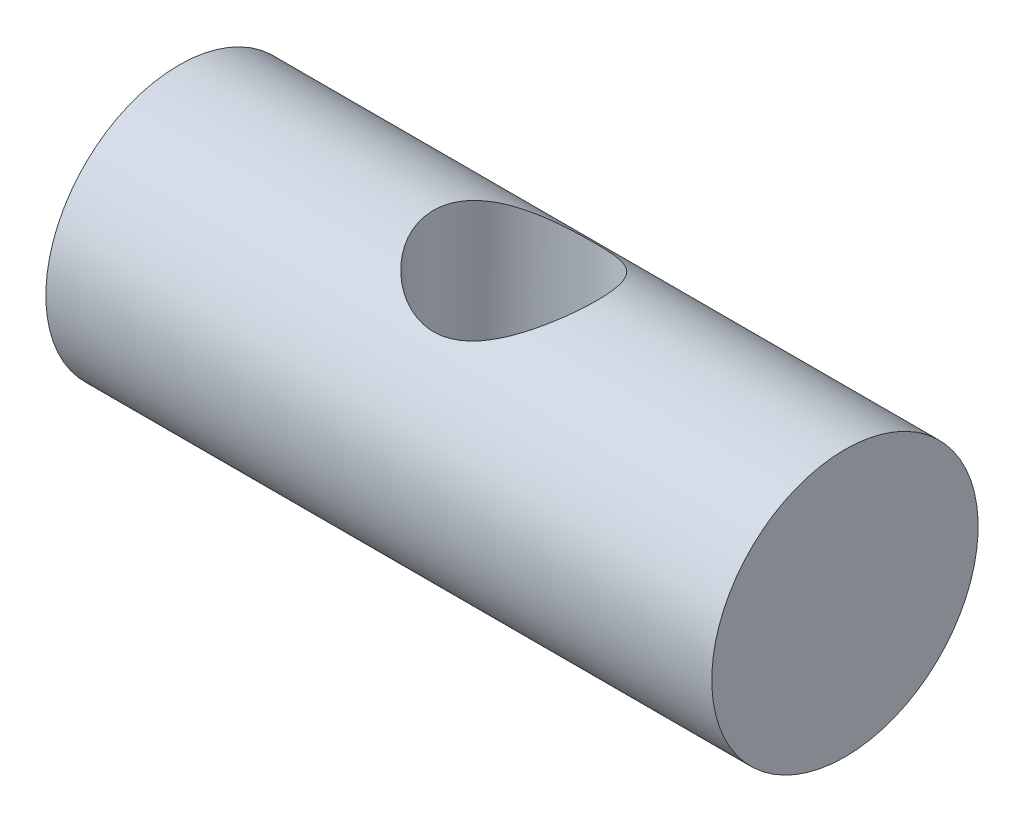
ISO-10303-21;
HEADER;
FILE_DESCRIPTION(('STEP AP214'),'2;1');
FILE_NAME('part.step','',(''),(''),'','','');
FILE_SCHEMA(('AUTOMOTIVE_DESIGN { 1 0 10303 214 1 1 1 1 }'));
ENDSEC;
DATA;
#1=APPLICATION_CONTEXT('core data for automotive mechanical design processes');
#2=APPLICATION_PROTOCOL_DEFINITION('international standard','automotive_design',2000,#1);
#3=PRODUCT_CONTEXT('',#1,'mechanical');
#4=PRODUCT('Part','Part','',(#3));
#5=PRODUCT_RELATED_PRODUCT_CATEGORY('part','',(#4));
#6=PRODUCT_DEFINITION_FORMATION('','',#4);
#7=PRODUCT_DEFINITION_CONTEXT('part definition',#1,'design');
#8=PRODUCT_DEFINITION('design','',#6,#7);
#9=PRODUCT_DEFINITION_SHAPE('','',#8);
#10=(LENGTH_UNIT() NAMED_UNIT(*) SI_UNIT(.MILLI.,.METRE.));
#11=(NAMED_UNIT(*) PLANE_ANGLE_UNIT() SI_UNIT($,.RADIAN.));
#12=(NAMED_UNIT(*) SI_UNIT($,.STERADIAN.) SOLID_ANGLE_UNIT());
#13=UNCERTAINTY_MEASURE_WITH_UNIT(LENGTH_MEASURE(1.E-05),#10,'distance_accuracy_value','');
#14=(GEOMETRIC_REPRESENTATION_CONTEXT(3) GLOBAL_UNCERTAINTY_ASSIGNED_CONTEXT((#13)) GLOBAL_UNIT_ASSIGNED_CONTEXT((#10,
#11,#12)) REPRESENTATION_CONTEXT('',''));
#15=CARTESIAN_POINT('',(0.,0.,0.));
#16=DIRECTION('',(0.,0.,1.));
#17=DIRECTION('',(1.,0.,0.));
#18=AXIS2_PLACEMENT_3D('',#15,#16,#17);
#19=CARTESIAN_POINT('',(0.,-18.7521667780927,11.6949636286788));
#20=DIRECTION('',(1.,0.,0.));
#21=DIRECTION('',(0.,0.,-1.));
#22=AXIS2_PLACEMENT_3D('',#19,#20,#21);
#23=CYLINDRICAL_SURFACE('',#22,5.);
#24=CARTESIAN_POINT('',(0.,-22.7079728146669,14.7530019870064));
#25=CARTESIAN_POINT('',(-0.0754616103656692,-22.7079727869881,14.7530018925849));
#26=CARTESIAN_POINT('',(-0.150919951825714,-22.7101598235113,14.7501801945999));
#27=CARTESIAN_POINT('',(-0.301183579155884,-22.7187979706071,14.7389544448188));
#28=CARTESIAN_POINT('',(-0.375988603680727,-22.7252507149352,14.7305482541699));
#29=CARTESIAN_POINT('',(-0.598542400800131,-22.7506525182684,14.6971206700838));
#30=CARTESIAN_POINT('',(-0.744466163038655,-22.7756453398218,14.6638901730738));
#31=CARTESIAN_POINT('',(-1.02619529387303,-22.8377881740495,14.5777461448535));
#32=CARTESIAN_POINT('',(-1.16206540972156,-22.8748502020465,14.5249746967277));
#33=CARTESIAN_POINT('',(-1.42286717142597,-22.9568438354341,14.4016544141652));
#34=CARTESIAN_POINT('',(-1.54779553947816,-23.0017777869929,14.3311002769724));
#35=CARTESIAN_POINT('',(-1.79990131024536,-23.1011785218747,14.164099369169));
#36=CARTESIAN_POINT('',(-1.92548608074575,-23.1561391267282,14.0655415030308));
#37=CARTESIAN_POINT('',(-2.15952535636892,-23.2657354853162,13.8495886872096));
#38=CARTESIAN_POINT('',(-2.26796690142325,-23.3203709635155,13.7321796201239));
#39=CARTESIAN_POINT('',(-2.47628246871425,-23.430340638655,13.4662497393904));
#40=CARTESIAN_POINT('',(-2.57396641364106,-23.4851130558413,13.3157383303768));
#41=CARTESIAN_POINT('',(-2.69974650858798,-23.558227357613,13.0765525795957));
#42=CARTESIAN_POINT('',(-2.73822411545812,-23.581096983841,12.9945605709474));
#43=CARTESIAN_POINT('',(-2.80779096487915,-23.6231850085312,12.8266215817503));
#44=CARTESIAN_POINT('',(-2.83888509171158,-23.6424058190417,12.7406772608897));
#45=CARTESIAN_POINT('',(-2.8906274624533,-23.6749802775516,12.5738461548146));
#46=CARTESIAN_POINT('',(-2.91198727152911,-23.6887177555667,12.4932541311213));
#47=CARTESIAN_POINT('',(-2.94794996135097,-23.7123521960503,12.3300637651993));
#48=CARTESIAN_POINT('',(-2.96255660763761,-23.7222512982862,12.2474665681582));
#49=CARTESIAN_POINT('',(-2.9847846845161,-23.7379430868827,12.0809888844705));
#50=CARTESIAN_POINT('',(-2.99240984231181,-23.7437379639894,11.9971091069025));
#51=CARTESIAN_POINT('',(-3.00056663984719,-23.7510849265537,11.8288489482711));
#52=CARTESIAN_POINT('',(-3.00109900129357,-23.7526374436676,11.744468619014));
#53=CARTESIAN_POINT('',(-2.99275721772027,-23.7510105836798,11.51270324337));
#54=CARTESIAN_POINT('',(-2.97652885035086,-23.7434090717095,11.3655279041117));
#55=CARTESIAN_POINT('',(-2.92304450631759,-23.7158840522797,11.0763592621349));
#56=CARTESIAN_POINT('',(-2.88578697338951,-23.6959596328524,10.9343663437699));
#57=CARTESIAN_POINT('',(-2.79166776699806,-23.6455113313597,10.6581382318312));
#58=CARTESIAN_POINT('',(-2.73469357980009,-23.6149266085636,10.5239528406406));
#59=CARTESIAN_POINT('',(-2.60323106554831,-23.5457065476715,10.2667672196502));
#60=CARTESIAN_POINT('',(-2.52873818986415,-23.5070691190319,10.1437699062945));
#61=CARTESIAN_POINT('',(-2.35432172038149,-23.419657287531,9.89672028803383));
#62=CARTESIAN_POINT('',(-2.2524233514645,-23.3702233180452,9.77429678895081));
#63=CARTESIAN_POINT('',(-2.03119178989515,-23.2690931673724,9.54720485534209));
#64=CARTESIAN_POINT('',(-1.91183500028096,-23.2173939918253,9.44256087223243));
#65=CARTESIAN_POINT('',(-1.64269317960226,-23.1106424638974,9.24179343494802));
#66=CARTESIAN_POINT('',(-1.49098484467041,-23.0558958428153,9.148062790343));
#67=CARTESIAN_POINT('',(-1.17058753897335,-22.9571237667411,8.98807902740353));
#68=CARTESIAN_POINT('',(-1.00193056868577,-22.9130786247414,8.92177529269688));
#69=CARTESIAN_POINT('',(-0.695212735504382,-22.8522758915277,8.83292726574572));
#70=CARTESIAN_POINT('',(-0.559918734207678,-22.8314618326231,8.80361235572529));
#71=CARTESIAN_POINT('',(-0.285252780598748,-22.8031999975291,8.76413643568933));
#72=CARTESIAN_POINT('',(-0.145885763115504,-22.7957366766823,8.75395314946577));
#73=CARTESIAN_POINT('',(0.133103368961626,-22.7952919170322,8.75334175749415));
#74=CARTESIAN_POINT('',(0.272725569601709,-22.802330541752,8.76294102101923));
#75=CARTESIAN_POINT('',(0.547974672313762,-22.8298474377343,8.80134077935364));
#76=CARTESIAN_POINT('',(0.683598327819899,-22.8503363319316,8.83015645144216));
#77=CARTESIAN_POINT('',(0.947429215549469,-22.901941299012,8.90544338226318));
#78=CARTESIAN_POINT('',(1.07564548413754,-22.9330440894804,8.9518925822231));
#79=CARTESIAN_POINT('',(1.32295522030751,-23.002481214324,9.06076717792625));
#80=CARTESIAN_POINT('',(1.4420452245939,-23.0408182750867,9.12319860008104));
#81=CARTESIAN_POINT('',(1.6904810952463,-23.1286721740687,9.27520997795065));
#82=CARTESIAN_POINT('',(1.81780543232944,-23.1789585203737,9.3676551847835));
#83=CARTESIAN_POINT('',(2.05656720394541,-23.2800688266411,9.57104086893459));
#84=CARTESIAN_POINT('',(2.16798924609444,-23.3308932570144,9.68199904333049));
#85=CARTESIAN_POINT('',(2.38646399131574,-23.4350388514412,9.93658208126711));
#86=CARTESIAN_POINT('',(2.49106470576288,-23.4878253551495,10.0825785290202));
#87=CARTESIAN_POINT('',(2.62815449772339,-23.5587985520089,10.3154964334324));
#88=CARTESIAN_POINT('',(2.67056200213691,-23.5810956833224,10.3954905050181));
#89=CARTESIAN_POINT('',(2.74830388347848,-23.6223025521498,10.5596586571418));
#90=CARTESIAN_POINT('',(2.7836427131187,-23.6412144213199,10.6438300643077));
#91=CARTESIAN_POINT('',(2.84447964323442,-23.6738151854542,10.8095326534457));
#92=CARTESIAN_POINT('',(2.87050371846178,-23.687782431425,10.8908163099147));
#93=CARTESIAN_POINT('',(2.91566498160908,-23.7118447299035,11.055793770821));
#94=CARTESIAN_POINT('',(2.9348060288799,-23.7219419525641,11.1394861961254));
#95=CARTESIAN_POINT('',(2.96590030971309,-23.7379341186137,11.3085423049022));
#96=CARTESIAN_POINT('',(2.97785843736055,-23.7438319237867,11.393904809425));
#97=CARTESIAN_POINT('',(2.99440676165901,-23.7512298155536,11.5654990854394));
#98=CARTESIAN_POINT('',(2.99899791878894,-23.7527304754525,11.6517307421387));
#99=CARTESIAN_POINT('',(3.0013282897594,-23.7506843562619,11.8874289341162));
#100=CARTESIAN_POINT('',(2.99160107457409,-23.7426436972747,12.0370212978));
#101=CARTESIAN_POINT('',(2.95021794585105,-23.7136685232393,12.3317423440264));
#102=CARTESIAN_POINT('',(2.9185617880599,-23.6927338645727,12.4768709768313));
#103=CARTESIAN_POINT('',(2.83555942935371,-23.6401845511299,12.7566735548822));
#104=CARTESIAN_POINT('',(2.78453656045099,-23.6087462382718,12.8914776747676));
#105=CARTESIAN_POINT('',(2.66471905823651,-23.5375077488372,13.1504998117461));
#106=CARTESIAN_POINT('',(2.59592043965643,-23.4977056975103,13.2747154466174));
#107=CARTESIAN_POINT('',(2.43415009310424,-23.4078520497102,13.5236084965356));
#108=CARTESIAN_POINT('',(2.33936493647195,-23.3571568395582,13.6468721086891));
#109=CARTESIAN_POINT('',(2.1324915754345,-23.2528541033737,13.8766539923056));
#110=CARTESIAN_POINT('',(2.0203842023356,-23.199243394177,13.9831534458078));
#111=CARTESIAN_POINT('',(1.76543895662125,-23.0867873288138,14.1902857763759));
#112=CARTESIAN_POINT('',(1.6205069155109,-23.0281402958731,14.2884620128758));
#113=CARTESIAN_POINT('',(1.31299042740473,-22.9198062299684,14.4592073038831));
#114=CARTESIAN_POINT('',(1.15041521580196,-22.8701145451891,14.5317896718642));
#115=CARTESIAN_POINT('',(0.903377447312357,-22.8100237606539,14.616411162026));
#116=CARTESIAN_POINT('',(0.824341408702766,-22.7929264257422,14.6399417433211));
#117=CARTESIAN_POINT('',(0.663869558199827,-22.7629859844,14.6805907074968));
#118=CARTESIAN_POINT('',(0.582435300012668,-22.7501401868469,14.6977131474807));
#119=CARTESIAN_POINT('',(0.417953449305935,-22.729330091554,14.7252228332853));
#120=CARTESIAN_POINT('',(0.33490863162827,-22.7213580549682,14.7356207582155));
#121=CARTESIAN_POINT('',(0.167907783336379,-22.7106797632751,14.7495099529906));
#122=CARTESIAN_POINT('',(0.0839518687375867,-22.7079728454599,14.7530020920513));
#123=CARTESIAN_POINT('',(0.,-22.7079728146669,14.7530019870064));
#124=B_SPLINE_CURVE_WITH_KNOTS('',3,(#24,#25,#26,#27,#28,#29,#30,#31,#32,#33,#34,#35,#36,#37,
#38,#39,#40,#41,#42,#43,#44,#45,#46,#47,#48,#49,#50,#51,#52,#53,#54,#55,#56,#57,#58,#59,#60,#61,
#62,#63,#64,#65,#66,#67,#68,#69,#70,#71,#72,#73,#74,#75,#76,#77,#78,#79,#80,#81,#82,#83,#84,#85,
#86,#87,#88,#89,#90,#91,#92,#93,#94,#95,#96,#97,#98,#99,#100,#101,#102,#103,#104,#105,#106,#107,
#108,#109,#110,#111,#112,#113,#114,#115,#116,#117,#118,#119,#120,#121,#122,#123),.UNSPECIFIED.,
.T.,.F.,(4,2,2,2,2,2,2,2,2,2,2,2,2,2,2,2,2,2,2,2,2,2,2,2,2,2,2,2,2,2,2,2,2,2,2,2,2,2,2,2,2,2,2,
2,2,2,2,2,2,4),(0.,0.226288173517878,0.452663065091106,0.905305714765855,1.35471981612576,
1.804268090599,2.30878181396805,2.81367513819685,3.37309572088443,3.65297634398311,
3.93267130287329,4.18580566749444,4.43879871451846,4.6916566173785,4.94448879122709,
5.38694235003539,5.82942865693065,6.27448283989929,6.71965270654932,7.21799594026829,
7.71701907227943,8.27387316194678,8.82969494223662,9.24786570023494,9.66554925202079,
10.0838110593649,10.5024036052238,10.9204742264512,11.3387027222345,11.8323285087813,
12.3264288987104,12.884776299373,13.1641700331408,13.4433872125907,13.7024631857776,
13.9613936663243,14.2201475237758,14.4788676430947,14.9267946196281,15.3747265854331,
15.8154875864153,16.2563474905318,16.7450674536299,17.2343321574792,17.7856420979722,
18.3366648323363,18.5890061072372,18.8411873492279,19.0929671157917,19.3447151893882),.UNSPECIFIED.);
#125=CARTESIAN_POINT('',(0.,-22.7079728146669,14.7530019870064));
#126=VERTEX_POINT('',#125);
#127=EDGE_CURVE('E51',#126,#126,#124,.T.);
#128=ORIENTED_EDGE('',*,*,#127,.F.);
#129=EDGE_LOOP('',(#128));
#130=FACE_BOUND('',#129,.T.);
#131=CARTESIAN_POINT('',(0.,-14.7088242638575,14.6362866834584));
#132=CARTESIAN_POINT('',(0.0754616103656553,-14.7088242942793,14.6362865898846));
#133=CARTESIAN_POINT('',(0.1509199518257,-14.7067205138531,14.6334022847359));
#134=CARTESIAN_POINT('',(0.30118357915587,-14.6984135633696,14.6219292896143));
#135=CARTESIAN_POINT('',(0.375988603680713,-14.692208822655,14.613338414033));
#136=CARTESIAN_POINT('',(0.598542400800118,-14.667793106764,14.5791839442238));
#137=CARTESIAN_POINT('',(0.744466163038641,-14.6437804483911,14.5452384099285));
#138=CARTESIAN_POINT('',(1.02619529387302,-14.5841773825658,14.4573179914349));
#139=CARTESIAN_POINT('',(1.16206540972155,-14.548670776959,14.4034876968525));
#140=CARTESIAN_POINT('',(1.42286717142596,-14.4703100064979,14.2778276886552));
#141=CARTESIAN_POINT('',(1.54779553947815,-14.4274536511858,14.2059926060906));
#142=CARTESIAN_POINT('',(1.79990131024535,-14.3329676031741,14.036162702854));
#143=CARTESIAN_POINT('',(1.92548608074573,-14.2809058918976,13.9360432777531));
#144=CARTESIAN_POINT('',(2.1595253563689,-14.1776567676555,13.7169848407549));
#145=CARTESIAN_POINT('',(2.26796690142324,-14.1264700419933,13.5980317255036));
#146=CARTESIAN_POINT('',(2.47628246871423,-14.024305876991,13.3290066071473));
#147=CARTESIAN_POINT('',(2.57396641364105,-13.973948055308,13.1769612464058));
#148=CARTESIAN_POINT('',(2.69974650858797,-13.9078432950131,12.9357441550407));
#149=CARTESIAN_POINT('',(2.73822411545811,-13.8873755803447,12.8531198127302));
#150=CARTESIAN_POINT('',(2.80779096487914,-13.8502052135932,12.6840243670481));
#151=CARTESIAN_POINT('',(2.83888509171156,-13.8335000728902,12.5975558518592));
#152=CARTESIAN_POINT('',(2.89062746245329,-13.8058068990872,12.4298453828176));
#153=CARTESIAN_POINT('',(2.91198727152909,-13.794426599489,12.3488868664882));
#154=CARTESIAN_POINT('',(2.94794996135095,-13.7755634167126,12.1850764191954));
#155=CARTESIAN_POINT('',(2.96255660763759,-13.7680783612664,12.1022255705027));
#156=CARTESIAN_POINT('',(2.98478468451609,-13.7572503590387,11.9353609374521));
#157=CARTESIAN_POINT('',(2.99240984231179,-13.7539052017559,11.8513477979542));
#158=CARTESIAN_POINT('',(3.00056663984717,-13.7514704781422,11.6829449150735));
#159=CARTESIAN_POINT('',(3.00109900129355,-13.7523804788275,11.5985552108811));
#160=CARTESIAN_POINT('',(2.99275721772025,-13.7607685680447,11.3669359630193));
#161=CARTESIAN_POINT('',(2.97652885035084,-13.7726607905773,11.2200450561759));
#162=CARTESIAN_POINT('',(2.92304450631757,-13.8086107959856,10.9318025761206));
#163=CARTESIAN_POINT('',(2.88578697338949,-13.8326694792269,10.7904514137057));
#164=CARTESIAN_POINT('',(2.79166776699804,-13.8911554589267,10.5158127581468));
#165=CARTESIAN_POINT('',(2.73469357980007,-13.9256421171956,10.3825768212568));
#166=CARTESIAN_POINT('',(2.6032310655483,-14.0023362867298,10.1275202298235));
#167=CARTESIAN_POINT('',(2.52873818986414,-14.0445458025594,10.0057025514758));
#168=CARTESIAN_POINT('',(2.35432172038148,-14.1391282732493,9.76130840586815));
#169=CARTESIAN_POINT('',(2.25242335146449,-14.192112992372,9.64037929437576));
#170=CARTESIAN_POINT('',(2.03119178989513,-14.2998256624924,9.41633457923884));
#171=CARTESIAN_POINT('',(1.91183500028094,-14.3545558931879,9.31324350396395));
#172=CARTESIAN_POINT('',(1.64269317960225,-14.467119511389,9.11567608649296));
#173=CARTESIAN_POINT('',(1.49098484467039,-14.5245774858036,9.02358261531205));
#174=CARTESIAN_POINT('',(1.17058753897333,-14.6279751559417,8.86654870424088));
#175=CARTESIAN_POINT('',(1.00193056868575,-14.6739360070609,8.80155824390853));
#176=CARTESIAN_POINT('',(0.695212735504366,-14.7373050616213,8.71452200327564));
#177=CARTESIAN_POINT('',(0.559918734207662,-14.7589655435574,8.68582683783125));
#178=CARTESIAN_POINT('',(0.285252780598731,-14.788367085937,8.64719228216835));
#179=CARTESIAN_POINT('',(0.145885763115487,-14.7961243343448,8.63723107875141));
#180=CARTESIAN_POINT('',(-0.133103368961643,-14.796586742461,8.63663292323371));
#181=CARTESIAN_POINT('',(-0.272725569601725,-14.7892710486692,8.6460227433872));
#182=CARTESIAN_POINT('',(-0.547974672313779,-14.7606455260722,8.68360332960788));
#183=CARTESIAN_POINT('',(-0.683598327819915,-14.7393246360463,8.71180895656148));
#184=CARTESIAN_POINT('',(-0.947429215549485,-14.6855450868608,8.78555822550174));
#185=CARTESIAN_POINT('',(-1.07564548413756,-14.6531003480421,8.83108020563027));
#186=CARTESIAN_POINT('',(-1.32295522030753,-14.5805162879596,8.93788257507038));
#187=CARTESIAN_POINT('',(-1.44204522459391,-14.5403740656442,8.99916890868374));
#188=CARTESIAN_POINT('',(-1.69048109524631,-14.4481225247865,9.14855237422644));
#189=CARTESIAN_POINT('',(-1.81780543232945,-14.3951604299744,9.23949108657812));
#190=CARTESIAN_POINT('',(-2.05656720394542,-14.2881592427163,9.43984022302861));
#191=CARTESIAN_POINT('',(-2.16798924609445,-14.2341191637348,9.54926832294684));
#192=CARTESIAN_POINT('',(-2.38646399131576,-14.1225902607687,9.80070446165151));
#193=CARTESIAN_POINT('',(-2.4910647057629,-14.0655666768455,9.945098674163));
#194=CARTESIAN_POINT('',(-2.6281544977234,-13.9878281457698,10.1758467308274));
#195=CARTESIAN_POINT('',(-2.67056200213692,-13.9632066217261,10.2551562139139));
#196=CARTESIAN_POINT('',(-2.7483038834785,-13.9172275706457,10.4180522392553));
#197=CARTESIAN_POINT('',(-2.78364271311871,-13.895867990858,10.5016360470837));
#198=CARTESIAN_POINT('',(-2.84447964323443,-13.8584466125301,10.6663169455303));
#199=CARTESIAN_POINT('',(-2.8705037184618,-13.8421138032128,10.7471584949266));
#200=CARTESIAN_POINT('',(-2.91566498160909,-13.8132484118378,10.9113636897163));
#201=CARTESIAN_POINT('',(-2.93480602887992,-13.8007137007883,10.9947258932482));
#202=CARTESIAN_POINT('',(-2.9659003097131,-13.7797960088815,11.163243451547));
#203=CARTESIAN_POINT('',(-2.97785843736056,-13.7714102018552,11.2483975443716));
#204=CARTESIAN_POINT('',(-2.99440676165902,-13.7590090727743,11.4197029335484));
#205=CARTESIAN_POINT('',(-2.99899791878896,-13.754993181008,11.5058540984306));
#206=CARTESIAN_POINT('',(-3.00132828975941,-13.7501617646253,11.7415116502319));
#207=CARTESIAN_POINT('',(-2.99160107457411,-13.7538345357188,11.8912749241743));
#208=CARTESIAN_POINT('',(-2.95021794585106,-13.7741986761402,12.1867158786543));
#209=CARTESIAN_POINT('',(-2.91856178805992,-13.7908901904763,12.3323935136656));
#210=CARTESIAN_POINT('',(-2.83555942935372,-13.8352536918038,12.6136101432898));
#211=CARTESIAN_POINT('',(-2.78453656045101,-13.8627456140071,12.749274112224));
#212=CARTESIAN_POINT('',(-2.66471905823652,-13.9263966196454,13.0102644172223));
#213=CARTESIAN_POINT('',(-2.59592043965644,-13.9625576465355,13.1355884267758));
#214=CARTESIAN_POINT('',(-2.43415009310425,-14.0451114094417,13.3869970673405));
#215=CARTESIAN_POINT('',(-2.33936493647196,-14.0921887338668,13.5116872752097));
#216=CARTESIAN_POINT('',(-2.13249157543451,-14.189743016196,13.7444144476953));
#217=CARTESIAN_POINT('',(-2.02038420233561,-14.2402237049368,13.8524326952329));
#218=CARTESIAN_POINT('',(-1.76543895662126,-14.3465886625825,14.0627578358808));
#219=CARTESIAN_POINT('',(-1.62050691551091,-14.4023463669463,14.1626033479989));
#220=CARTESIAN_POINT('',(-1.31299042740474,-14.5056526979673,14.3364366768158));
#221=CARTESIAN_POINT('',(-1.15041521580197,-14.5532055860294,14.410437937041));
#222=CARTESIAN_POINT('',(-0.90337744731237,-14.6108018968683,14.4967765955955));
#223=CARTESIAN_POINT('',(-0.824341408702779,-14.6272054317519,14.5207959869386));
#224=CARTESIAN_POINT('',(-0.663869558199842,-14.6559471645787,14.5623011807152));
#225=CARTESIAN_POINT('',(-0.582435300012683,-14.6682879341301,14.5797911170403));
#226=CARTESIAN_POINT('',(-0.41795344930595,-14.6882865556251,14.607896241439));
#227=CARTESIAN_POINT('',(-0.334908631628284,-14.6959518315495,14.6185223298624));
#228=CARTESIAN_POINT('',(-0.167907783336393,-14.7062203502104,14.6327171588327));
#229=CARTESIAN_POINT('',(-0.083951868737601,-14.7088242300128,14.6362867875602));
#230=CARTESIAN_POINT('',(0.,-14.7088242638575,14.6362866834584));
#231=B_SPLINE_CURVE_WITH_KNOTS('',3,(#131,#132,#133,#134,#135,#136,#137,#138,#139,#140,#141,
#142,#143,#144,#145,#146,#147,#148,#149,#150,#151,#152,#153,#154,#155,#156,#157,#158,#159,#160,
#161,#162,#163,#164,#165,#166,#167,#168,#169,#170,#171,#172,#173,#174,#175,#176,#177,#178,#179,
#180,#181,#182,#183,#184,#185,#186,#187,#188,#189,#190,#191,#192,#193,#194,#195,#196,#197,#198,
#199,#200,#201,#202,#203,#204,#205,#206,#207,#208,#209,#210,#211,#212,#213,#214,#215,#216,#217,
#218,#219,#220,#221,#222,#223,#224,#225,#226,#227,#228,#229,#230),.UNSPECIFIED.,.T.,.F.,(4,2,2,
2,2,2,2,2,2,2,2,2,2,2,2,2,2,2,2,2,2,2,2,2,2,2,2,2,2,2,2,2,2,2,2,2,2,2,2,2,2,2,2,2,2,2,2,2,2,4),
(0.,0.226288173517879,0.452663065091107,0.905305714765856,1.35471981612576,1.804268090599,
2.30878181396805,2.81367513819685,3.37309572088444,3.65297634398311,3.93267130287329,
4.18580566749444,4.43879871451846,4.69165661737851,4.94448879122709,5.38694235003539,
5.82942865693065,6.27448283989929,6.71965270654932,7.21799594026829,7.71701907227943,
8.27387316194679,8.82969494223662,9.24786570023494,9.66554925202079,10.0838110593649,
10.5024036052238,10.9204742264512,11.3387027222345,11.8323285087813,12.3264288987104,
12.884776299373,13.1641700331408,13.4433872125907,13.7024631857776,13.9613936663243,
14.2201475237758,14.4788676430947,14.9267946196281,15.3747265854331,15.8154875864153,
16.2563474905318,16.7450674536299,17.2343321574792,17.7856420979722,18.3366648323363,
18.5890061072372,18.8411873492279,19.0929671157917,19.3447151893882),.UNSPECIFIED.);
#232=CARTESIAN_POINT('',(0.,-14.7088242638575,14.6362866834584));
#233=VERTEX_POINT('',#232);
#234=EDGE_CURVE('E42',#233,#233,#231,.T.);
#235=ORIENTED_EDGE('',*,*,#234,.F.);
#236=EDGE_LOOP('',(#235));
#237=FACE_BOUND('',#236,.T.);
#238=CARTESIAN_POINT('',(-12.5,-18.7521667780927,11.6949636286788));
#239=DIRECTION('',(-1.,0.,0.));
#240=DIRECTION('',(0.,-1.,0.));
#241=AXIS2_PLACEMENT_3D('',#238,#239,#240);
#242=CIRCLE('',#241,5.);
#243=CARTESIAN_POINT('',(-12.5,-23.7521667780927,11.6949636286788));
#244=VERTEX_POINT('',#243);
#245=EDGE_CURVE('E10',#244,#244,#242,.T.);
#246=ORIENTED_EDGE('',*,*,#245,.F.);
#247=EDGE_LOOP('',(#246));
#248=FACE_BOUND('',#247,.T.);
#249=CARTESIAN_POINT('',(12.5,-18.7521667780927,11.6949636286788));
#250=DIRECTION('',(1.,0.,0.));
#251=DIRECTION('',(0.,1.,0.));
#252=AXIS2_PLACEMENT_3D('',#249,#250,#251);
#253=CIRCLE('',#252,5.);
#254=CARTESIAN_POINT('',(12.5,-13.7521667780927,11.6949636286788));
#255=VERTEX_POINT('',#254);
#256=EDGE_CURVE('E35',#255,#255,#253,.F.);
#257=ORIENTED_EDGE('',*,*,#256,.T.);
#258=EDGE_LOOP('',(#257));
#259=FACE_BOUND('',#258,.T.);
#260=ADVANCED_FACE('F32',(#130,#237,#248,#259),#23,.T.);
#261=CARTESIAN_POINT('',(-12.5,-18.7667561910362,10.6950700598276));
#262=DIRECTION('',(-1.,0.,0.));
#263=DIRECTION('',(0.,-1.,0.));
#264=AXIS2_PLACEMENT_3D('',#261,#262,#263);
#265=PLANE('',#264);
#266=ORIENTED_EDGE('',*,*,#245,.T.);
#267=EDGE_LOOP('',(#266));
#268=FACE_BOUND('',#267,.T.);
#269=ADVANCED_FACE('F64',(#268),#265,.T.);
#270=CARTESIAN_POINT('',(12.5,-18.7667561910362,10.6950700598276));
#271=DIRECTION('',(1.,0.,0.));
#272=DIRECTION('',(0.,1.,0.));
#273=AXIS2_PLACEMENT_3D('',#270,#271,#272);
#274=PLANE('',#273);
#275=ORIENTED_EDGE('',*,*,#256,.F.);
#276=EDGE_LOOP('',(#275));
#277=FACE_BOUND('',#276,.T.);
#278=ADVANCED_FACE('F60',(#277),#274,.T.);
#279=CARTESIAN_POINT('',(0.,-20.1281920417709,11.7150411663467));
#280=DIRECTION('',(0.,0.999893568851187,-0.014589412943501));
#281=DIRECTION('',(0.,0.014589412943501,0.999893568851187));
#282=AXIS2_PLACEMENT_3D('',#279,#280,#281);
#283=CYLINDRICAL_SURFACE('',#282,3.);
#284=ORIENTED_EDGE('',*,*,#127,.T.);
#285=EDGE_LOOP('',(#284));
#286=FACE_BOUND('',#285,.T.);
#287=ORIENTED_EDGE('',*,*,#234,.T.);
#288=EDGE_LOOP('',(#287));
#289=FACE_BOUND('',#288,.T.);
#290=ADVANCED_FACE('F56',(#286,#289),#283,.F.);
#291=CLOSED_SHELL('',(#260,#269,#278,#290));
#292=MANIFOLD_SOLID_BREP('B2',#291);
#293=ADVANCED_BREP_SHAPE_REPRESENTATION('',(#18,#292),#14);
#294=SHAPE_DEFINITION_REPRESENTATION(#9,#293);
ENDSEC;
END-ISO-10303-21;
